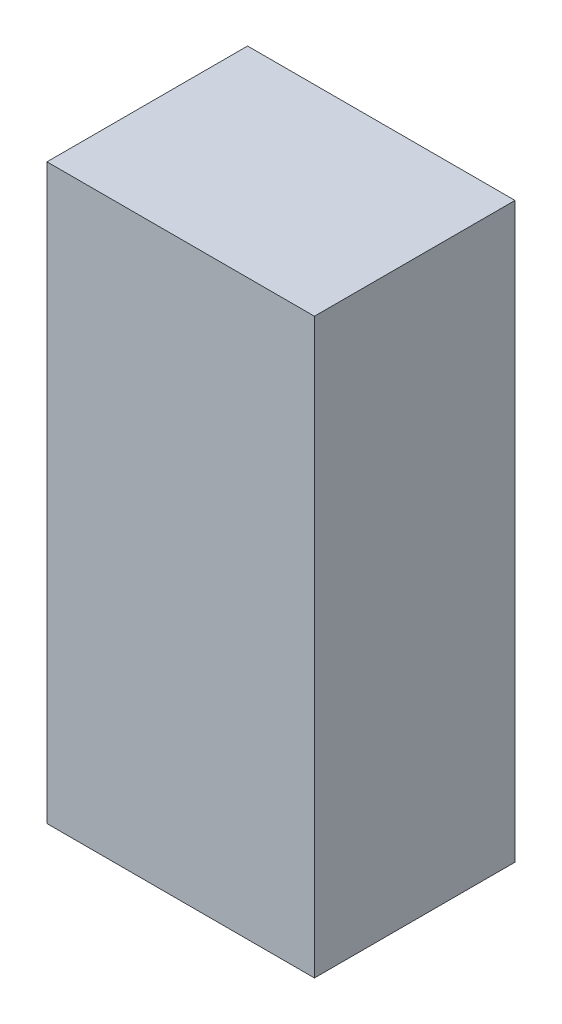
ISO-10303-21;
HEADER;
FILE_DESCRIPTION(('STEP AP214'),'2;1');
FILE_NAME('part.step','',(''),(''),'','','');
FILE_SCHEMA(('AUTOMOTIVE_DESIGN { 1 0 10303 214 1 1 1 1 }'));
ENDSEC;
DATA;
#1=APPLICATION_CONTEXT('core data for automotive mechanical design processes');
#2=APPLICATION_PROTOCOL_DEFINITION('international standard','automotive_design',2000,#1);
#3=PRODUCT_CONTEXT('',#1,'mechanical');
#4=PRODUCT('Part','Part','',(#3));
#5=PRODUCT_RELATED_PRODUCT_CATEGORY('part','',(#4));
#6=PRODUCT_DEFINITION_FORMATION('','',#4);
#7=PRODUCT_DEFINITION_CONTEXT('part definition',#1,'design');
#8=PRODUCT_DEFINITION('design','',#6,#7);
#9=PRODUCT_DEFINITION_SHAPE('','',#8);
#10=(LENGTH_UNIT() NAMED_UNIT(*) SI_UNIT(.MILLI.,.METRE.));
#11=(NAMED_UNIT(*) PLANE_ANGLE_UNIT() SI_UNIT($,.RADIAN.));
#12=(NAMED_UNIT(*) SI_UNIT($,.STERADIAN.) SOLID_ANGLE_UNIT());
#13=UNCERTAINTY_MEASURE_WITH_UNIT(LENGTH_MEASURE(1.E-05),#10,'distance_accuracy_value','');
#14=(GEOMETRIC_REPRESENTATION_CONTEXT(3) GLOBAL_UNCERTAINTY_ASSIGNED_CONTEXT((#13)) GLOBAL_UNIT_ASSIGNED_CONTEXT((#10,
#11,#12)) REPRESENTATION_CONTEXT('',''));
#15=CARTESIAN_POINT('',(0.,0.,0.));
#16=DIRECTION('',(0.,0.,1.));
#17=DIRECTION('',(1.,0.,0.));
#18=AXIS2_PLACEMENT_3D('',#15,#16,#17);
#19=CARTESIAN_POINT('',(0.70000114,1.49999954,0.0499999));
#20=DIRECTION('',(1.,0.,0.));
#21=DIRECTION('',(0.,-1.,0.));
#22=AXIS2_PLACEMENT_3D('',#19,#20,#21);
#23=PLANE('',#22);
#24=DIRECTION('',(0.,0.,1.));
#25=VECTOR('',#24,1.);
#26=CARTESIAN_POINT('',(0.70000114,1.49999954,0.0499999));
#27=LINE('',#26,#25);
#28=CARTESIAN_POINT('',(0.70000114,1.49999954,0.0499999));
#29=VERTEX_POINT('',#28);
#30=CARTESIAN_POINT('',(0.70000114,1.49999954,1.10000034));
#31=VERTEX_POINT('',#30);
#32=EDGE_CURVE('E11',#29,#31,#27,.T.);
#33=ORIENTED_EDGE('',*,*,#32,.T.);
#34=DIRECTION('',(0.,-1.,0.));
#35=VECTOR('',#34,1.);
#36=CARTESIAN_POINT('',(0.70000114,1.49999954,1.10000034));
#37=LINE('',#36,#35);
#38=CARTESIAN_POINT('',(0.70000114,-1.49999954,1.10000034));
#39=VERTEX_POINT('',#38);
#40=EDGE_CURVE('E24',#31,#39,#37,.T.);
#41=ORIENTED_EDGE('',*,*,#40,.T.);
#42=DIRECTION('',(0.,0.,1.));
#43=VECTOR('',#42,1.);
#44=CARTESIAN_POINT('',(0.70000114,-1.49999954,0.0499999));
#45=LINE('',#44,#43);
#46=CARTESIAN_POINT('',(0.70000114,-1.49999954,0.0499999));
#47=VERTEX_POINT('',#46);
#48=EDGE_CURVE('E102',#47,#39,#45,.T.);
#49=ORIENTED_EDGE('',*,*,#48,.F.);
#50=DIRECTION('',(0.,-1.,0.));
#51=VECTOR('',#50,1.);
#52=CARTESIAN_POINT('',(0.70000114,1.49999954,0.0499999));
#53=LINE('',#52,#51);
#54=EDGE_CURVE('E99',#29,#47,#53,.T.);
#55=ORIENTED_EDGE('',*,*,#54,.F.);
#56=EDGE_LOOP('',(#33,#41,#49,#55));
#57=FACE_BOUND('',#56,.T.);
#58=ADVANCED_FACE('F16',(#57),#23,.T.);
#59=CARTESIAN_POINT('',(0.70000114,-1.49999954,0.0499999));
#60=DIRECTION('',(0.,-1.,0.));
#61=DIRECTION('',(-1.,0.,0.));
#62=AXIS2_PLACEMENT_3D('',#59,#60,#61);
#63=PLANE('',#62);
#64=ORIENTED_EDGE('',*,*,#48,.T.);
#65=DIRECTION('',(-1.,0.,0.));
#66=VECTOR('',#65,1.);
#67=CARTESIAN_POINT('',(0.70000114,-1.49999954,1.10000034));
#68=LINE('',#67,#66);
#69=CARTESIAN_POINT('',(-0.6999986,-1.49999954,1.10000034));
#70=VERTEX_POINT('',#69);
#71=EDGE_CURVE('E95',#39,#70,#68,.T.);
#72=ORIENTED_EDGE('',*,*,#71,.T.);
#73=DIRECTION('',(0.,0.,1.));
#74=VECTOR('',#73,1.);
#75=CARTESIAN_POINT('',(-0.6999986,-1.49999954,0.0499999));
#76=LINE('',#75,#74);
#77=CARTESIAN_POINT('',(-0.6999986,-1.49999954,0.0499999));
#78=VERTEX_POINT('',#77);
#79=EDGE_CURVE('E92',#78,#70,#76,.T.);
#80=ORIENTED_EDGE('',*,*,#79,.F.);
#81=DIRECTION('',(-1.,0.,0.));
#82=VECTOR('',#81,1.);
#83=CARTESIAN_POINT('',(0.70000114,-1.49999954,0.0499999));
#84=LINE('',#83,#82);
#85=EDGE_CURVE('E67',#47,#78,#84,.T.);
#86=ORIENTED_EDGE('',*,*,#85,.F.);
#87=EDGE_LOOP('',(#64,#72,#80,#86));
#88=FACE_BOUND('',#87,.T.);
#89=ADVANCED_FACE('F110',(#88),#63,.T.);
#90=CARTESIAN_POINT('',(-0.6999986,-1.49999954,0.0499999));
#91=DIRECTION('',(-1.,0.,0.));
#92=DIRECTION('',(0.,1.,0.));
#93=AXIS2_PLACEMENT_3D('',#90,#91,#92);
#94=PLANE('',#93);
#95=ORIENTED_EDGE('',*,*,#79,.T.);
#96=DIRECTION('',(0.,1.,0.));
#97=VECTOR('',#96,1.);
#98=CARTESIAN_POINT('',(-0.6999986,-1.49999954,1.10000034));
#99=LINE('',#98,#97);
#100=CARTESIAN_POINT('',(-0.6999986,1.49999954,1.10000034));
#101=VERTEX_POINT('',#100);
#102=EDGE_CURVE('E82',#70,#101,#99,.T.);
#103=ORIENTED_EDGE('',*,*,#102,.T.);
#104=DIRECTION('',(0.,0.,1.));
#105=VECTOR('',#104,1.);
#106=CARTESIAN_POINT('',(-0.6999986,1.49999954,0.0499999));
#107=LINE('',#106,#105);
#108=CARTESIAN_POINT('',(-0.6999986,1.49999954,0.0499999));
#109=VERTEX_POINT('',#108);
#110=EDGE_CURVE('E72',#109,#101,#107,.T.);
#111=ORIENTED_EDGE('',*,*,#110,.F.);
#112=DIRECTION('',(0.,1.,0.));
#113=VECTOR('',#112,1.);
#114=CARTESIAN_POINT('',(-0.6999986,-1.49999954,0.0499999));
#115=LINE('',#114,#113);
#116=EDGE_CURVE('E63',#78,#109,#115,.T.);
#117=ORIENTED_EDGE('',*,*,#116,.F.);
#118=EDGE_LOOP('',(#95,#103,#111,#117));
#119=FACE_BOUND('',#118,.T.);
#120=ADVANCED_FACE('F80',(#119),#94,.T.);
#121=CARTESIAN_POINT('',(-0.6999986,1.49999954,0.0499999));
#122=DIRECTION('',(0.,1.,0.));
#123=DIRECTION('',(1.,0.,0.));
#124=AXIS2_PLACEMENT_3D('',#121,#122,#123);
#125=PLANE('',#124);
#126=ORIENTED_EDGE('',*,*,#110,.T.);
#127=DIRECTION('',(1.,0.,0.));
#128=VECTOR('',#127,1.);
#129=CARTESIAN_POINT('',(-0.6999986,1.49999954,1.10000034));
#130=LINE('',#129,#128);
#131=EDGE_CURVE('E73',#101,#31,#130,.T.);
#132=ORIENTED_EDGE('',*,*,#131,.T.);
#133=ORIENTED_EDGE('',*,*,#32,.F.);
#134=DIRECTION('',(1.,0.,0.));
#135=VECTOR('',#134,1.);
#136=CARTESIAN_POINT('',(-0.6999986,1.49999954,0.0499999));
#137=LINE('',#136,#135);
#138=EDGE_CURVE('E65',#109,#29,#137,.T.);
#139=ORIENTED_EDGE('',*,*,#138,.F.);
#140=EDGE_LOOP('',(#126,#132,#133,#139));
#141=FACE_BOUND('',#140,.T.);
#142=ADVANCED_FACE('F76',(#141),#125,.T.);
#143=CARTESIAN_POINT('',(1.269999998472E-06,0.,0.0499999));
#144=DIRECTION('',(0.,0.,-1.));
#145=DIRECTION('',(0.,1.,0.));
#146=AXIS2_PLACEMENT_3D('',#143,#144,#145);
#147=PLANE('',#146);
#148=ORIENTED_EDGE('',*,*,#54,.T.);
#149=ORIENTED_EDGE('',*,*,#85,.T.);
#150=ORIENTED_EDGE('',*,*,#116,.T.);
#151=ORIENTED_EDGE('',*,*,#138,.T.);
#152=EDGE_LOOP('',(#148,#149,#150,#151));
#153=FACE_BOUND('',#152,.T.);
#154=ADVANCED_FACE('F64',(#153),#147,.T.);
#155=CARTESIAN_POINT('',(1.269999998472E-06,0.,1.10000034));
#156=DIRECTION('',(0.,0.,-1.));
#157=DIRECTION('',(0.,1.,0.));
#158=AXIS2_PLACEMENT_3D('',#155,#156,#157);
#159=PLANE('',#158);
#160=ORIENTED_EDGE('',*,*,#131,.F.);
#161=ORIENTED_EDGE('',*,*,#102,.F.);
#162=ORIENTED_EDGE('',*,*,#71,.F.);
#163=ORIENTED_EDGE('',*,*,#40,.F.);
#164=EDGE_LOOP('',(#160,#161,#162,#163));
#165=FACE_BOUND('',#164,.T.);
#166=ADVANCED_FACE('F111',(#165),#159,.F.);
#167=CLOSED_SHELL('',(#58,#89,#120,#142,#154,#166));
#168=MANIFOLD_SOLID_BREP('B1',#167);
#169=ADVANCED_BREP_SHAPE_REPRESENTATION('',(#18,#168),#14);
#170=SHAPE_DEFINITION_REPRESENTATION(#9,#169);
ENDSEC;
END-ISO-10303-21;
